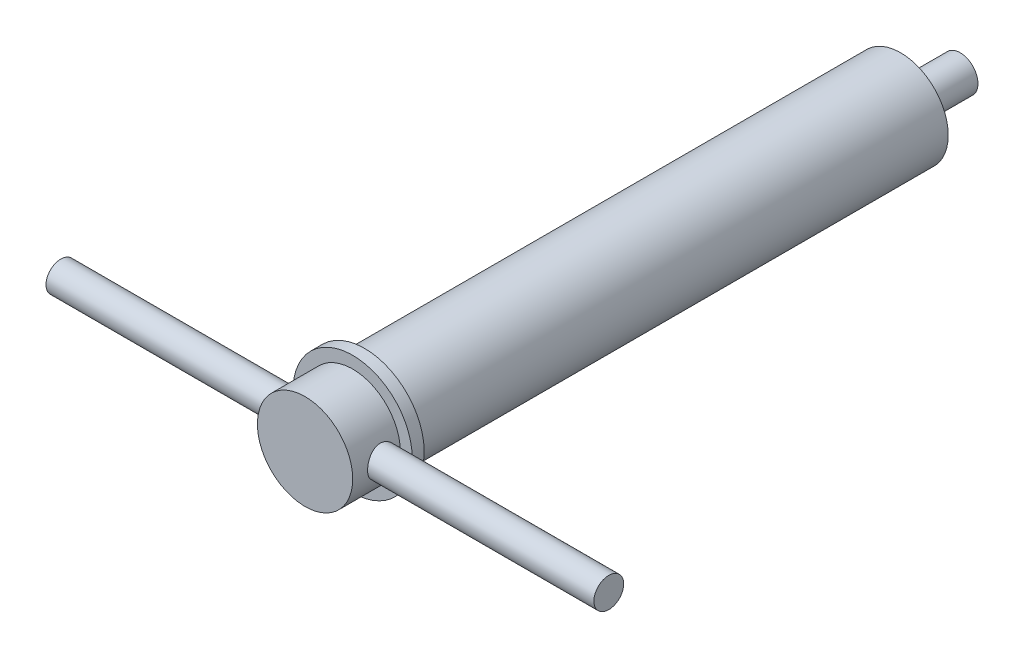
ISO-10303-21;
HEADER;
FILE_DESCRIPTION(('STEP AP214'),'2;1');
FILE_NAME('part.step','',(''),(''),'','','');
FILE_SCHEMA(('AUTOMOTIVE_DESIGN { 1 0 10303 214 1 1 1 1 }'));
ENDSEC;
DATA;
#1=APPLICATION_CONTEXT('core data for automotive mechanical design processes');
#2=APPLICATION_PROTOCOL_DEFINITION('international standard','automotive_design',2000,#1);
#3=PRODUCT_CONTEXT('',#1,'mechanical');
#4=PRODUCT('Part','Part','',(#3));
#5=PRODUCT_RELATED_PRODUCT_CATEGORY('part','',(#4));
#6=PRODUCT_DEFINITION_FORMATION('','',#4);
#7=PRODUCT_DEFINITION_CONTEXT('part definition',#1,'design');
#8=PRODUCT_DEFINITION('design','',#6,#7);
#9=PRODUCT_DEFINITION_SHAPE('','',#8);
#10=(LENGTH_UNIT() NAMED_UNIT(*) SI_UNIT(.MILLI.,.METRE.));
#11=(NAMED_UNIT(*) PLANE_ANGLE_UNIT() SI_UNIT($,.RADIAN.));
#12=(NAMED_UNIT(*) SI_UNIT($,.STERADIAN.) SOLID_ANGLE_UNIT());
#13=UNCERTAINTY_MEASURE_WITH_UNIT(LENGTH_MEASURE(1.E-05),#10,'distance_accuracy_value','');
#14=(GEOMETRIC_REPRESENTATION_CONTEXT(3) GLOBAL_UNCERTAINTY_ASSIGNED_CONTEXT((#13)) GLOBAL_UNIT_ASSIGNED_CONTEXT((#10,
#11,#12)) REPRESENTATION_CONTEXT('',''));
#15=CARTESIAN_POINT('',(0.,0.,0.));
#16=DIRECTION('',(0.,0.,1.));
#17=DIRECTION('',(1.,0.,0.));
#18=AXIS2_PLACEMENT_3D('',#15,#16,#17);
#19=CARTESIAN_POINT('',(0.,0.,0.));
#20=DIRECTION('',(0.,0.,1.));
#21=DIRECTION('',(1.,0.,0.));
#22=AXIS2_PLACEMENT_3D('',#19,#20,#21);
#23=PLANE('',#22);
#24=CARTESIAN_POINT('',(0.,0.,0.));
#25=DIRECTION('',(0.,0.,1.));
#26=DIRECTION('',(1.,0.,0.));
#27=AXIS2_PLACEMENT_3D('',#24,#25,#26);
#28=CIRCLE('',#27,4.);
#29=CARTESIAN_POINT('',(4.,0.,0.));
#30=VERTEX_POINT('',#29);
#31=EDGE_CURVE('E90',#30,#30,#28,.T.);
#32=ORIENTED_EDGE('',*,*,#31,.F.);
#33=EDGE_LOOP('',(#32));
#34=FACE_BOUND('',#33,.T.);
#35=CARTESIAN_POINT('',(0.,0.,0.));
#36=DIRECTION('',(0.,0.,1.));
#37=DIRECTION('',(1.,0.,0.));
#38=AXIS2_PLACEMENT_3D('',#35,#36,#37);
#39=CIRCLE('',#38,1.5);
#40=CARTESIAN_POINT('',(1.5,0.,0.));
#41=VERTEX_POINT('',#40);
#42=EDGE_CURVE('E10',#41,#41,#39,.F.);
#43=ORIENTED_EDGE('',*,*,#42,.F.);
#44=EDGE_LOOP('',(#43));
#45=FACE_BOUND('',#44,.T.);
#46=ADVANCED_FACE('F30',(#34,#45),#23,.F.);
#47=CARTESIAN_POINT('',(0.,0.,50.));
#48=DIRECTION('',(0.,0.,-1.));
#49=DIRECTION('',(-1.,0.,0.));
#50=AXIS2_PLACEMENT_3D('',#47,#48,#49);
#51=CYLINDRICAL_SURFACE('',#50,4.);
#52=CARTESIAN_POINT('',(4.,0.,48.75));
#53=CARTESIAN_POINT('',(3.99999965877989,-0.068439185174546,48.7499995534124));
#54=CARTESIAN_POINT('',(3.99822694984841,-0.136883052502858,48.7443607730555));
#55=CARTESIAN_POINT('',(3.99132894088807,-0.271769209588447,48.7220137584608));
#56=CARTESIAN_POINT('',(3.9862028819986,-0.338211042725906,48.7053030186356));
#57=CARTESIAN_POINT('',(3.97315815697909,-0.467128543650807,48.6614306288043));
#58=CARTESIAN_POINT('',(3.96524381499025,-0.529610176985805,48.634285155347));
#59=CARTESIAN_POINT('',(3.94743969161093,-0.649134802346461,48.5703826823217));
#60=CARTESIAN_POINT('',(3.93754959899905,-0.706176935444885,48.5336241682194));
#61=CARTESIAN_POINT('',(3.91650213740282,-0.814965334952279,48.4503440079826));
#62=CARTESIAN_POINT('',(3.90531715926989,-0.866520028156657,48.4035791149389));
#63=CARTESIAN_POINT('',(3.88310046374209,-0.961197382036991,48.3021316075865));
#64=CARTESIAN_POINT('',(3.87206877523457,-1.0043184728987,48.2474475225055));
#65=CARTESIAN_POINT('',(3.85111144698172,-1.08194336483113,48.1300554361919));
#66=CARTESIAN_POINT('',(3.84121988301796,-1.11620784150129,48.0671825224728));
#67=CARTESIAN_POINT('',(3.82407801799234,-1.17359741076671,47.9362076850181));
#68=CARTESIAN_POINT('',(3.81682702128689,-1.19672543771944,47.8681071442061));
#69=CARTESIAN_POINT('',(3.80607606984501,-1.23048459930033,47.7307719225479));
#70=CARTESIAN_POINT('',(3.80246972929508,-1.24147110007865,47.6616331563611));
#71=CARTESIAN_POINT('',(3.7991005514095,-1.25174555036988,47.5224068810881));
#72=CARTESIAN_POINT('',(3.79933669227334,-1.25103660995772,47.4523196291783));
#73=CARTESIAN_POINT('',(3.80353189075438,-1.23821824732739,47.316125539731));
#74=CARTESIAN_POINT('',(3.80734341745949,-1.22656057869383,47.2499708741384));
#75=CARTESIAN_POINT('',(3.81802025652489,-1.19290813355626,47.1206078434627));
#76=CARTESIAN_POINT('',(3.82488589343115,-1.1709122584455,47.0573997922912));
#77=CARTESIAN_POINT('',(3.84101044014297,-1.11688874681277,46.9346480555674));
#78=CARTESIAN_POINT('',(3.85030284660825,-1.08471925662081,46.875171389308));
#79=CARTESIAN_POINT('',(3.8702185658007,-1.01136020737847,46.7623122321209));
#80=CARTESIAN_POINT('',(3.88084222394551,-0.970168305215767,46.7089313297463));
#81=CARTESIAN_POINT('',(3.90281527800493,-0.87771695418212,46.607225056583));
#82=CARTESIAN_POINT('',(3.91417569605696,-0.826084570592814,46.5592404422203));
#83=CARTESIAN_POINT('',(3.9359157075958,-0.715364408095527,46.4725281064203));
#84=CARTESIAN_POINT('',(3.94629522838372,-0.656276077349016,46.4338010707808));
#85=CARTESIAN_POINT('',(3.96501294890191,-0.531664610465451,46.3664723113987));
#86=CARTESIAN_POINT('',(3.97333460648208,-0.466094906919277,46.337951864536));
#87=CARTESIAN_POINT('',(3.98687955828554,-0.330767977782643,46.2924469991484));
#88=CARTESIAN_POINT('',(3.99210379325151,-0.261012030724607,46.2754590777616));
#89=CARTESIAN_POINT('',(3.99871389395014,-0.122185157290344,46.254081957421));
#90=CARTESIAN_POINT('',(4.00024022895439,-0.0531918487888412,46.2492314564065));
#91=CARTESIAN_POINT('',(3.99969799730981,0.0846303057325858,46.2509662266373));
#92=CARTESIAN_POINT('',(3.99762995581125,0.153459174306507,46.2575498273226));
#93=CARTESIAN_POINT('',(3.99022363769772,0.287219332975852,46.2815955926064));
#94=CARTESIAN_POINT('',(3.98496793110725,0.352204978420948,46.2987832676125));
#95=CARTESIAN_POINT('',(3.97180121379252,0.478351928861366,46.3432143523667));
#96=CARTESIAN_POINT('',(3.96388987514203,0.539512760449017,46.3704590040249));
#97=CARTESIAN_POINT('',(3.94598542759568,0.657932406672231,46.4349732165488));
#98=CARTESIAN_POINT('',(3.9359462681821,0.715059739787952,46.4724709874972));
#99=CARTESIAN_POINT('',(3.91493410002887,0.822365850960092,46.556153210117));
#100=CARTESIAN_POINT('',(3.90396083845862,0.872542738043335,46.6023400177431));
#101=CARTESIAN_POINT('',(3.88176994885247,0.966587462919655,46.7042588900537));
#102=CARTESIAN_POINT('',(3.87055986714446,1.01012652339773,46.7602966637453));
#103=CARTESIAN_POINT('',(3.84961947087602,1.08721250244909,46.8791266163707));
#104=CARTESIAN_POINT('',(3.839889132814,1.12075957972524,46.9419186880044));
#105=CARTESIAN_POINT('',(3.82311782360754,1.17670083481141,47.0723451728859));
#106=CARTESIAN_POINT('',(3.81606646468027,1.19913819558885,47.1399596495047));
#107=CARTESIAN_POINT('',(3.80551170941212,1.23222894320963,47.2782724933238));
#108=CARTESIAN_POINT('',(3.80200696302675,1.2428868141461,47.3489696763713));
#109=CARTESIAN_POINT('',(3.79908292712494,1.2517940615754,47.4880040875542));
#110=CARTESIAN_POINT('',(3.79948604683077,1.25058279621957,47.5563034538129));
#111=CARTESIAN_POINT('',(3.80390090472383,1.23708818129474,47.6916745849192));
#112=CARTESIAN_POINT('',(3.80791247457319,1.22480534822559,47.758746406884));
#113=CARTESIAN_POINT('',(3.81896814158112,1.18987729913378,47.8887940396018));
#114=CARTESIAN_POINT('',(3.82596698183474,1.16738642405944,47.951815441096));
#115=CARTESIAN_POINT('',(3.84219704261348,1.11280227335064,48.0732404135314));
#116=CARTESIAN_POINT('',(3.85142871716522,1.08070704444254,48.1316430420777));
#117=CARTESIAN_POINT('',(3.8715348703158,1.00635675013475,48.2446459704406));
#118=CARTESIAN_POINT('',(3.88245948922441,0.96375333524127,48.2990081295004));
#119=CARTESIAN_POINT('',(3.90448998821726,0.870208996404844,48.3999863281118));
#120=CARTESIAN_POINT('',(3.91559591606795,0.819265842344399,48.446600288991));
#121=CARTESIAN_POINT('',(3.93717271952329,0.708486662823328,48.532282538363));
#122=CARTESIAN_POINT('',(3.94761101730634,0.648414574487377,48.57105473645));
#123=CARTESIAN_POINT('',(3.96626769296917,0.52227913801365,48.6378989151394));
#124=CARTESIAN_POINT('',(3.97448694315832,0.456218157795446,48.6659751021418));
#125=CARTESIAN_POINT('',(3.98720650733461,0.325747635373974,48.7085913676085));
#126=CARTESIAN_POINT('',(3.99196240806139,0.261670337112543,48.7240748673053));
#127=CARTESIAN_POINT('',(3.99835900340486,0.131729895440246,48.7447783599677));
#128=CARTESIAN_POINT('',(4.00000032839644,0.0658671161396741,48.750000429804));
#129=CARTESIAN_POINT('',(4.,0.,48.75));
#130=B_SPLINE_CURVE_WITH_KNOTS('',3,(#52,#53,#54,#55,#56,#57,#58,#59,#60,#61,#62,#63,#64,#65,
#66,#67,#68,#69,#70,#71,#72,#73,#74,#75,#76,#77,#78,#79,#80,#81,#82,#83,#84,#85,#86,#87,#88,#89,
#90,#91,#92,#93,#94,#95,#96,#97,#98,#99,#100,#101,#102,#103,#104,#105,#106,#107,#108,#109,#110,
#111,#112,#113,#114,#115,#116,#117,#118,#119,#120,#121,#122,#123,#124,#125,#126,#127,#128,#129),
.UNSPECIFIED.,.T.,.F.,(4,2,2,2,2,2,2,2,2,2,2,2,2,2,2,2,2,2,2,2,2,2,2,2,2,2,2,2,2,2,2,2,2,2,2,2,
2,2,4),(0.,0.205075449432509,0.410197323349066,0.615002479202437,0.819839921558393,
1.03037822195158,1.24095567431276,1.45673771247494,1.67246286279526,1.88169150167211,
2.09086450295138,2.29176917422169,2.49269519979063,2.69655642720546,2.90047066010358,
3.113667472796,3.32688007413303,3.5417546068977,3.75656384494553,3.96307568548237,
4.16955735649362,4.37090626722871,4.57228005034499,4.77856324738342,4.98490245709258,
5.19941778713139,5.41392970983711,5.6276011575103,5.84119123892429,6.04512203476052,
6.24904331751084,6.4499791339667,6.65095584330173,6.85979514006361,7.0686903737334,
7.28440668126411,7.50003806666336,7.6974463665154,7.89481470763046),.UNSPECIFIED.);
#131=CARTESIAN_POINT('',(4.,0.,48.75));
#132=VERTEX_POINT('',#131);
#133=EDGE_CURVE('E42',#132,#132,#130,.T.);
#134=ORIENTED_EDGE('',*,*,#133,.F.);
#135=EDGE_LOOP('',(#134));
#136=FACE_BOUND('',#135,.T.);
#137=CARTESIAN_POINT('',(0.,0.,46.));
#138=DIRECTION('',(0.,0.,1.));
#139=DIRECTION('',(1.,0.,0.));
#140=AXIS2_PLACEMENT_3D('',#137,#138,#139);
#141=CIRCLE('',#140,4.);
#142=CARTESIAN_POINT('',(4.,0.,46.));
#143=VERTEX_POINT('',#142);
#144=EDGE_CURVE('E93',#143,#143,#141,.T.);
#145=ORIENTED_EDGE('',*,*,#144,.T.);
#146=EDGE_LOOP('',(#145));
#147=FACE_BOUND('',#146,.T.);
#148=CARTESIAN_POINT('',(0.,0.,50.));
#149=DIRECTION('',(0.,0.,1.));
#150=DIRECTION('',(1.,0.,0.));
#151=AXIS2_PLACEMENT_3D('',#148,#149,#150);
#152=CIRCLE('',#151,4.);
#153=CARTESIAN_POINT('',(4.,0.,50.));
#154=VERTEX_POINT('',#153);
#155=EDGE_CURVE('E92',#154,#154,#152,.T.);
#156=ORIENTED_EDGE('',*,*,#155,.F.);
#157=EDGE_LOOP('',(#156));
#158=FACE_BOUND('',#157,.T.);
#159=CARTESIAN_POINT('',(-4.,0.,48.75));
#160=CARTESIAN_POINT('',(-3.99999965877989,0.068439185174546,48.7499995534124));
#161=CARTESIAN_POINT('',(-3.99822694984841,0.136883052502858,48.7443607730555));
#162=CARTESIAN_POINT('',(-3.99132894088807,0.271769209588447,48.7220137584608));
#163=CARTESIAN_POINT('',(-3.9862028819986,0.338211042725906,48.7053030186356));
#164=CARTESIAN_POINT('',(-3.97315815697909,0.467128543650807,48.6614306288043));
#165=CARTESIAN_POINT('',(-3.96524381499025,0.529610176985805,48.634285155347));
#166=CARTESIAN_POINT('',(-3.94743969161093,0.649134802346461,48.5703826823217));
#167=CARTESIAN_POINT('',(-3.93754959899905,0.706176935444885,48.5336241682194));
#168=CARTESIAN_POINT('',(-3.91650213740282,0.814965334952279,48.4503440079826));
#169=CARTESIAN_POINT('',(-3.90531715926989,0.866520028156657,48.4035791149389));
#170=CARTESIAN_POINT('',(-3.88310046374209,0.961197382036991,48.3021316075865));
#171=CARTESIAN_POINT('',(-3.87206877523457,1.0043184728987,48.2474475225055));
#172=CARTESIAN_POINT('',(-3.85111144698172,1.08194336483113,48.1300554361919));
#173=CARTESIAN_POINT('',(-3.84121988301796,1.11620784150129,48.0671825224728));
#174=CARTESIAN_POINT('',(-3.82407801799234,1.17359741076671,47.9362076850181));
#175=CARTESIAN_POINT('',(-3.81682702128689,1.19672543771944,47.8681071442061));
#176=CARTESIAN_POINT('',(-3.80607606984501,1.23048459930033,47.7307719225479));
#177=CARTESIAN_POINT('',(-3.80246972929508,1.24147110007865,47.6616331563611));
#178=CARTESIAN_POINT('',(-3.7991005514095,1.25174555036988,47.5224068810881));
#179=CARTESIAN_POINT('',(-3.79933669227334,1.25103660995772,47.4523196291783));
#180=CARTESIAN_POINT('',(-3.80353189075438,1.23821824732739,47.316125539731));
#181=CARTESIAN_POINT('',(-3.80734341745949,1.22656057869383,47.2499708741384));
#182=CARTESIAN_POINT('',(-3.81802025652489,1.19290813355626,47.1206078434627));
#183=CARTESIAN_POINT('',(-3.82488589343115,1.1709122584455,47.0573997922912));
#184=CARTESIAN_POINT('',(-3.84101044014297,1.11688874681277,46.9346480555674));
#185=CARTESIAN_POINT('',(-3.85030284660825,1.08471925662081,46.875171389308));
#186=CARTESIAN_POINT('',(-3.8702185658007,1.01136020737847,46.7623122321209));
#187=CARTESIAN_POINT('',(-3.88084222394551,0.970168305215767,46.7089313297463));
#188=CARTESIAN_POINT('',(-3.90281527800493,0.87771695418212,46.607225056583));
#189=CARTESIAN_POINT('',(-3.91417569605696,0.826084570592814,46.5592404422203));
#190=CARTESIAN_POINT('',(-3.9359157075958,0.715364408095527,46.4725281064203));
#191=CARTESIAN_POINT('',(-3.94629522838372,0.656276077349016,46.4338010707808));
#192=CARTESIAN_POINT('',(-3.96501294890191,0.531664610465451,46.3664723113987));
#193=CARTESIAN_POINT('',(-3.97333460648208,0.466094906919277,46.337951864536));
#194=CARTESIAN_POINT('',(-3.98687955828554,0.330767977782643,46.2924469991484));
#195=CARTESIAN_POINT('',(-3.99210379325151,0.261012030724607,46.2754590777616));
#196=CARTESIAN_POINT('',(-3.99871389395014,0.122185157290344,46.254081957421));
#197=CARTESIAN_POINT('',(-4.00024022895439,0.0531918487888412,46.2492314564065));
#198=CARTESIAN_POINT('',(-3.99969799730981,-0.0846303057325858,46.2509662266373));
#199=CARTESIAN_POINT('',(-3.99762995581125,-0.153459174306507,46.2575498273226));
#200=CARTESIAN_POINT('',(-3.99022363769772,-0.287219332975852,46.2815955926064));
#201=CARTESIAN_POINT('',(-3.98496793110725,-0.352204978420948,46.2987832676125));
#202=CARTESIAN_POINT('',(-3.97180121379252,-0.478351928861366,46.3432143523667));
#203=CARTESIAN_POINT('',(-3.96388987514203,-0.539512760449017,46.3704590040249));
#204=CARTESIAN_POINT('',(-3.94598542759568,-0.657932406672231,46.4349732165488));
#205=CARTESIAN_POINT('',(-3.9359462681821,-0.715059739787952,46.4724709874972));
#206=CARTESIAN_POINT('',(-3.91493410002887,-0.822365850960092,46.556153210117));
#207=CARTESIAN_POINT('',(-3.90396083845862,-0.872542738043335,46.6023400177431));
#208=CARTESIAN_POINT('',(-3.88176994885247,-0.966587462919655,46.7042588900537));
#209=CARTESIAN_POINT('',(-3.87055986714446,-1.01012652339773,46.7602966637453));
#210=CARTESIAN_POINT('',(-3.84961947087602,-1.08721250244909,46.8791266163707));
#211=CARTESIAN_POINT('',(-3.839889132814,-1.12075957972524,46.9419186880044));
#212=CARTESIAN_POINT('',(-3.82311782360754,-1.17670083481141,47.0723451728859));
#213=CARTESIAN_POINT('',(-3.81606646468027,-1.19913819558885,47.1399596495047));
#214=CARTESIAN_POINT('',(-3.80551170941212,-1.23222894320963,47.2782724933238));
#215=CARTESIAN_POINT('',(-3.80200696302675,-1.2428868141461,47.3489696763713));
#216=CARTESIAN_POINT('',(-3.79908292712494,-1.2517940615754,47.4880040875542));
#217=CARTESIAN_POINT('',(-3.79948604683077,-1.25058279621957,47.5563034538129));
#218=CARTESIAN_POINT('',(-3.80390090472383,-1.23708818129474,47.6916745849192));
#219=CARTESIAN_POINT('',(-3.80791247457319,-1.22480534822559,47.758746406884));
#220=CARTESIAN_POINT('',(-3.81896814158112,-1.18987729913378,47.8887940396018));
#221=CARTESIAN_POINT('',(-3.82596698183474,-1.16738642405944,47.951815441096));
#222=CARTESIAN_POINT('',(-3.84219704261348,-1.11280227335064,48.0732404135314));
#223=CARTESIAN_POINT('',(-3.85142871716522,-1.08070704444254,48.1316430420777));
#224=CARTESIAN_POINT('',(-3.8715348703158,-1.00635675013475,48.2446459704406));
#225=CARTESIAN_POINT('',(-3.88245948922441,-0.96375333524127,48.2990081295004));
#226=CARTESIAN_POINT('',(-3.90448998821726,-0.870208996404844,48.3999863281118));
#227=CARTESIAN_POINT('',(-3.91559591606795,-0.819265842344399,48.446600288991));
#228=CARTESIAN_POINT('',(-3.93717271952329,-0.708486662823328,48.532282538363));
#229=CARTESIAN_POINT('',(-3.94761101730634,-0.648414574487377,48.57105473645));
#230=CARTESIAN_POINT('',(-3.96626769296917,-0.52227913801365,48.6378989151394));
#231=CARTESIAN_POINT('',(-3.97448694315832,-0.456218157795446,48.6659751021418));
#232=CARTESIAN_POINT('',(-3.98720650733461,-0.325747635373974,48.7085913676085));
#233=CARTESIAN_POINT('',(-3.99196240806139,-0.261670337112543,48.7240748673053));
#234=CARTESIAN_POINT('',(-3.99835900340486,-0.131729895440246,48.7447783599677));
#235=CARTESIAN_POINT('',(-4.00000032839644,-0.0658671161396741,48.750000429804));
#236=CARTESIAN_POINT('',(-4.,0.,48.75));
#237=B_SPLINE_CURVE_WITH_KNOTS('',3,(#159,#160,#161,#162,#163,#164,#165,#166,#167,#168,#169,
#170,#171,#172,#173,#174,#175,#176,#177,#178,#179,#180,#181,#182,#183,#184,#185,#186,#187,#188,
#189,#190,#191,#192,#193,#194,#195,#196,#197,#198,#199,#200,#201,#202,#203,#204,#205,#206,#207,
#208,#209,#210,#211,#212,#213,#214,#215,#216,#217,#218,#219,#220,#221,#222,#223,#224,#225,#226,
#227,#228,#229,#230,#231,#232,#233,#234,#235,#236),.UNSPECIFIED.,.T.,.F.,(4,2,2,2,2,2,2,2,2,2,2,
2,2,2,2,2,2,2,2,2,2,2,2,2,2,2,2,2,2,2,2,2,2,2,2,2,2,2,4),(0.,0.205075449432509,
0.410197323349066,0.615002479202437,0.819839921558393,1.03037822195158,1.24095567431276,
1.45673771247494,1.67246286279526,1.88169150167211,2.09086450295138,2.29176917422169,
2.49269519979063,2.69655642720546,2.90047066010358,3.113667472796,3.32688007413303,
3.5417546068977,3.75656384494553,3.96307568548237,4.16955735649362,4.37090626722871,
4.57228005034499,4.77856324738342,4.98490245709258,5.19941778713139,5.41392970983711,
5.6276011575103,5.84119123892429,6.04512203476052,6.24904331751084,6.4499791339667,
6.65095584330173,6.85979514006361,7.0686903737334,7.28440668126411,7.50003806666336,
7.6974463665154,7.89481470763046),.UNSPECIFIED.);
#238=CARTESIAN_POINT('',(-4.,0.,48.75));
#239=VERTEX_POINT('',#238);
#240=EDGE_CURVE('E38',#239,#239,#237,.T.);
#241=ORIENTED_EDGE('',*,*,#240,.F.);
#242=EDGE_LOOP('',(#241));
#243=FACE_BOUND('',#242,.T.);
#244=ADVANCED_FACE('F32',(#136,#147,#158,#243),#51,.T.);
#245=ORIENTED_EDGE('',*,*,#31,.T.);
#246=EDGE_LOOP('',(#245));
#247=FACE_BOUND('',#246,.T.);
#248=CARTESIAN_POINT('',(0.,0.,45.));
#249=DIRECTION('',(0.,0.,1.));
#250=DIRECTION('',(1.,0.,0.));
#251=AXIS2_PLACEMENT_3D('',#248,#249,#250);
#252=CIRCLE('',#251,4.);
#253=CARTESIAN_POINT('',(4.,0.,45.));
#254=VERTEX_POINT('',#253);
#255=EDGE_CURVE('E46',#254,#254,#252,.T.);
#256=ORIENTED_EDGE('',*,*,#255,.F.);
#257=EDGE_LOOP('',(#256));
#258=FACE_BOUND('',#257,.T.);
#259=ADVANCED_FACE('F68',(#247,#258),#51,.T.);
#260=CARTESIAN_POINT('',(0.,0.,45.));
#261=DIRECTION('',(0.,0.,1.));
#262=DIRECTION('',(1.,0.,0.));
#263=AXIS2_PLACEMENT_3D('',#260,#261,#262);
#264=PLANE('',#263);
#265=CARTESIAN_POINT('',(0.,0.,45.));
#266=DIRECTION('',(0.,0.,1.));
#267=DIRECTION('',(1.,0.,0.));
#268=AXIS2_PLACEMENT_3D('',#265,#266,#267);
#269=CIRCLE('',#268,5.);
#270=CARTESIAN_POINT('',(5.,0.,45.));
#271=VERTEX_POINT('',#270);
#272=EDGE_CURVE('E98',#271,#271,#269,.T.);
#273=ORIENTED_EDGE('',*,*,#272,.F.);
#274=EDGE_LOOP('',(#273));
#275=FACE_BOUND('',#274,.T.);
#276=ORIENTED_EDGE('',*,*,#255,.T.);
#277=EDGE_LOOP('',(#276));
#278=FACE_BOUND('',#277,.T.);
#279=ADVANCED_FACE('F63',(#275,#278),#264,.F.);
#280=CARTESIAN_POINT('',(0.,0.,46.));
#281=DIRECTION('',(0.,0.,1.));
#282=DIRECTION('',(1.,0.,0.));
#283=AXIS2_PLACEMENT_3D('',#280,#281,#282);
#284=PLANE('',#283);
#285=CARTESIAN_POINT('',(0.,0.,46.));
#286=DIRECTION('',(0.,0.,1.));
#287=DIRECTION('',(1.,0.,0.));
#288=AXIS2_PLACEMENT_3D('',#285,#286,#287);
#289=CIRCLE('',#288,5.);
#290=CARTESIAN_POINT('',(5.,0.,46.));
#291=VERTEX_POINT('',#290);
#292=EDGE_CURVE('E206',#291,#291,#289,.T.);
#293=ORIENTED_EDGE('',*,*,#292,.T.);
#294=EDGE_LOOP('',(#293));
#295=FACE_BOUND('',#294,.T.);
#296=ORIENTED_EDGE('',*,*,#144,.F.);
#297=EDGE_LOOP('',(#296));
#298=FACE_BOUND('',#297,.T.);
#299=ADVANCED_FACE('F67',(#295,#298),#284,.T.);
#300=CARTESIAN_POINT('',(0.,0.,45.));
#301=DIRECTION('',(0.,0.,1.));
#302=DIRECTION('',(1.,0.,0.));
#303=AXIS2_PLACEMENT_3D('',#300,#301,#302);
#304=CYLINDRICAL_SURFACE('',#303,5.);
#305=ORIENTED_EDGE('',*,*,#272,.T.);
#306=EDGE_LOOP('',(#305));
#307=FACE_BOUND('',#306,.T.);
#308=ORIENTED_EDGE('',*,*,#292,.F.);
#309=EDGE_LOOP('',(#308));
#310=FACE_BOUND('',#309,.T.);
#311=ADVANCED_FACE('F72',(#307,#310),#304,.T.);
#312=CARTESIAN_POINT('',(0.,0.,50.));
#313=DIRECTION('',(0.,0.,1.));
#314=DIRECTION('',(1.,0.,0.));
#315=AXIS2_PLACEMENT_3D('',#312,#313,#314);
#316=PLANE('',#315);
#317=ORIENTED_EDGE('',*,*,#155,.T.);
#318=EDGE_LOOP('',(#317));
#319=FACE_BOUND('',#318,.T.);
#320=ADVANCED_FACE('F76',(#319),#316,.T.);
#321=CARTESIAN_POINT('',(23.,0.,47.5));
#322=DIRECTION('',(1.,0.,0.));
#323=DIRECTION('',(0.,0.,-1.));
#324=AXIS2_PLACEMENT_3D('',#321,#322,#323);
#325=PLANE('',#324);
#326=CARTESIAN_POINT('',(23.,0.,47.5));
#327=DIRECTION('',(1.,0.,0.));
#328=DIRECTION('',(0.,0.,-1.));
#329=AXIS2_PLACEMENT_3D('',#326,#327,#328);
#330=CIRCLE('',#329,1.25);
#331=CARTESIAN_POINT('',(23.,0.,46.25));
#332=VERTEX_POINT('',#331);
#333=EDGE_CURVE('E202',#332,#332,#330,.T.);
#334=ORIENTED_EDGE('',*,*,#333,.T.);
#335=EDGE_LOOP('',(#334));
#336=FACE_BOUND('',#335,.T.);
#337=ADVANCED_FACE('F79',(#336),#325,.T.);
#338=CARTESIAN_POINT('',(23.,0.,47.5));
#339=DIRECTION('',(-1.,0.,0.));
#340=DIRECTION('',(0.,0.,1.));
#341=AXIS2_PLACEMENT_3D('',#338,#339,#340);
#342=CYLINDRICAL_SURFACE('',#341,1.25);
#343=ORIENTED_EDGE('',*,*,#333,.F.);
#344=EDGE_LOOP('',(#343));
#345=FACE_BOUND('',#344,.T.);
#346=ORIENTED_EDGE('',*,*,#133,.T.);
#347=EDGE_LOOP('',(#346));
#348=FACE_BOUND('',#347,.T.);
#349=ADVANCED_FACE('F60',(#345,#348),#342,.T.);
#350=CARTESIAN_POINT('',(-23.,0.,47.5));
#351=DIRECTION('',(1.,0.,0.));
#352=DIRECTION('',(0.,0.,-1.));
#353=AXIS2_PLACEMENT_3D('',#350,#351,#352);
#354=CIRCLE('',#353,1.25);
#355=CARTESIAN_POINT('',(-23.,0.,46.25));
#356=VERTEX_POINT('',#355);
#357=EDGE_CURVE('E199',#356,#356,#354,.T.);
#358=ORIENTED_EDGE('',*,*,#357,.T.);
#359=EDGE_LOOP('',(#358));
#360=FACE_BOUND('',#359,.T.);
#361=ORIENTED_EDGE('',*,*,#240,.T.);
#362=EDGE_LOOP('',(#361));
#363=FACE_BOUND('',#362,.T.);
#364=ADVANCED_FACE('F54',(#360,#363),#342,.T.);
#365=CARTESIAN_POINT('',(-23.,0.,47.5));
#366=DIRECTION('',(1.,0.,0.));
#367=DIRECTION('',(0.,0.,-1.));
#368=AXIS2_PLACEMENT_3D('',#365,#366,#367);
#369=PLANE('',#368);
#370=ORIENTED_EDGE('',*,*,#357,.F.);
#371=EDGE_LOOP('',(#370));
#372=FACE_BOUND('',#371,.T.);
#373=ADVANCED_FACE('F59',(#372),#369,.F.);
#374=CARTESIAN_POINT('',(0.,0.,-5.));
#375=DIRECTION('',(0.,0.,1.));
#376=DIRECTION('',(1.,0.,0.));
#377=AXIS2_PLACEMENT_3D('',#374,#375,#376);
#378=CYLINDRICAL_SURFACE('',#377,1.5);
#379=CARTESIAN_POINT('',(0.,0.,-5.));
#380=DIRECTION('',(0.,0.,-1.));
#381=DIRECTION('',(-1.,0.,0.));
#382=AXIS2_PLACEMENT_3D('',#379,#380,#381);
#383=CIRCLE('',#382,1.5);
#384=CARTESIAN_POINT('',(-1.5,0.,-5.));
#385=VERTEX_POINT('',#384);
#386=EDGE_CURVE('E198',#385,#385,#383,.T.);
#387=ORIENTED_EDGE('',*,*,#386,.F.);
#388=EDGE_LOOP('',(#387));
#389=FACE_BOUND('',#388,.T.);
#390=ORIENTED_EDGE('',*,*,#42,.T.);
#391=EDGE_LOOP('',(#390));
#392=FACE_BOUND('',#391,.T.);
#393=ADVANCED_FACE('F148',(#389,#392),#378,.T.);
#394=CARTESIAN_POINT('',(0.,0.,-5.));
#395=DIRECTION('',(0.,0.,-1.));
#396=DIRECTION('',(-1.,0.,0.));
#397=AXIS2_PLACEMENT_3D('',#394,#395,#396);
#398=PLANE('',#397);
#399=ORIENTED_EDGE('',*,*,#386,.T.);
#400=EDGE_LOOP('',(#399));
#401=FACE_BOUND('',#400,.T.);
#402=ADVANCED_FACE('F155',(#401),#398,.T.);
#403=CLOSED_SHELL('',(#46,#244,#259,#279,#299,#311,#320,#337,#349,#364,#373,#393,#402));
#404=MANIFOLD_SOLID_BREP('B2',#403);
#405=ADVANCED_BREP_SHAPE_REPRESENTATION('',(#18,#404),#14);
#406=SHAPE_DEFINITION_REPRESENTATION(#9,#405);
ENDSEC;
END-ISO-10303-21;
